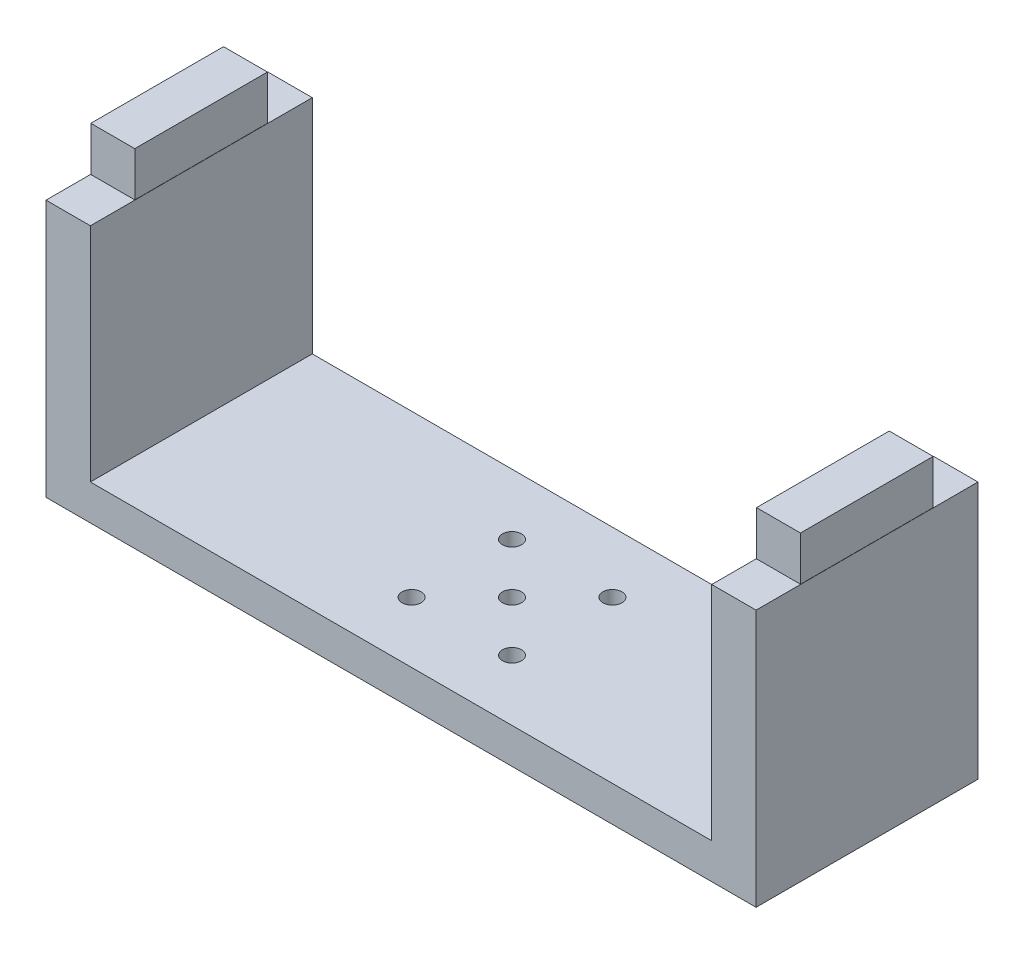
ISO-10303-21;
HEADER;
FILE_DESCRIPTION(('STEP AP214'),'2;1');
FILE_NAME('part.step','',(''),(''),'','','');
FILE_SCHEMA(('AUTOMOTIVE_DESIGN { 1 0 10303 214 1 1 1 1 }'));
ENDSEC;
DATA;
#1=APPLICATION_CONTEXT('core data for automotive mechanical design processes');
#2=APPLICATION_PROTOCOL_DEFINITION('international standard','automotive_design',2000,#1);
#3=PRODUCT_CONTEXT('',#1,'mechanical');
#4=PRODUCT('Part','Part','',(#3));
#5=PRODUCT_RELATED_PRODUCT_CATEGORY('part','',(#4));
#6=PRODUCT_DEFINITION_FORMATION('','',#4);
#7=PRODUCT_DEFINITION_CONTEXT('part definition',#1,'design');
#8=PRODUCT_DEFINITION('design','',#6,#7);
#9=PRODUCT_DEFINITION_SHAPE('','',#8);
#10=(LENGTH_UNIT() NAMED_UNIT(*) SI_UNIT(.MILLI.,.METRE.));
#11=(NAMED_UNIT(*) PLANE_ANGLE_UNIT() SI_UNIT($,.RADIAN.));
#12=(NAMED_UNIT(*) SI_UNIT($,.STERADIAN.) SOLID_ANGLE_UNIT());
#13=UNCERTAINTY_MEASURE_WITH_UNIT(LENGTH_MEASURE(1.E-05),#10,'distance_accuracy_value','');
#14=(GEOMETRIC_REPRESENTATION_CONTEXT(3) GLOBAL_UNCERTAINTY_ASSIGNED_CONTEXT((#13)) GLOBAL_UNIT_ASSIGNED_CONTEXT((#10,
#11,#12)) REPRESENTATION_CONTEXT('',''));
#15=CARTESIAN_POINT('',(0.,0.,0.));
#16=DIRECTION('',(0.,0.,1.));
#17=DIRECTION('',(1.,0.,0.));
#18=AXIS2_PLACEMENT_3D('',#15,#16,#17);
#19=CARTESIAN_POINT('',(0.,58.,0.));
#20=DIRECTION('',(0.,-1.,0.));
#21=DIRECTION('',(0.,0.,-1.));
#22=AXIS2_PLACEMENT_3D('',#19,#20,#21);
#23=PLANE('',#22);
#24=DIRECTION('',(0.,0.,-1.));
#25=VECTOR('',#24,1.);
#26=CARTESIAN_POINT('',(80.0000000000002,58.,-25.));
#27=LINE('',#26,#25);
#28=CARTESIAN_POINT('',(80.0000000000002,58.,25.));
#29=VERTEX_POINT('',#28);
#30=CARTESIAN_POINT('',(80.0000000000002,58.,-25.));
#31=VERTEX_POINT('',#30);
#32=EDGE_CURVE('E225',#29,#31,#27,.T.);
#33=ORIENTED_EDGE('',*,*,#32,.T.);
#34=DIRECTION('',(-1.,0.,0.));
#35=VECTOR('',#34,1.);
#36=CARTESIAN_POINT('',(80.0000000000002,58.,-25.));
#37=LINE('',#36,#35);
#38=CARTESIAN_POINT('',(70.0000000000002,58.,-25.));
#39=VERTEX_POINT('',#38);
#40=EDGE_CURVE('E229',#31,#39,#37,.T.);
#41=ORIENTED_EDGE('',*,*,#40,.T.);
#42=DIRECTION('',(0.,0.,1.));
#43=VECTOR('',#42,1.);
#44=CARTESIAN_POINT('',(70.0000000000002,58.,-25.));
#45=LINE('',#44,#43);
#46=CARTESIAN_POINT('',(70.0000000000001,58.,25.));
#47=VERTEX_POINT('',#46);
#48=EDGE_CURVE('E232',#39,#47,#45,.T.);
#49=ORIENTED_EDGE('',*,*,#48,.T.);
#50=DIRECTION('',(1.,0.,0.));
#51=VECTOR('',#50,1.);
#52=CARTESIAN_POINT('',(80.0000000000002,58.,25.));
#53=LINE('',#52,#51);
#54=EDGE_CURVE('E235',#47,#29,#53,.T.);
#55=ORIENTED_EDGE('',*,*,#54,.T.);
#56=EDGE_LOOP('',(#33,#41,#49,#55));
#57=FACE_BOUND('',#56,.T.);
#58=DIRECTION('',(0.,0.,1.));
#59=VECTOR('',#58,1.);
#60=CARTESIAN_POINT('',(70.0499999999999,58.,14.9499999999999));
#61=LINE('',#60,#59);
#62=CARTESIAN_POINT('',(70.0499999999999,58.,-14.95));
#63=VERTEX_POINT('',#62);
#64=CARTESIAN_POINT('',(70.0499999999999,58.,14.9499999999999));
#65=VERTEX_POINT('',#64);
#66=EDGE_CURVE('E175',#63,#65,#61,.T.);
#67=ORIENTED_EDGE('',*,*,#66,.F.);
#68=DIRECTION('',(-1.,0.,0.));
#69=VECTOR('',#68,1.);
#70=CARTESIAN_POINT('',(70.0499999999999,58.,-14.95));
#71=LINE('',#70,#69);
#72=CARTESIAN_POINT('',(79.9499999999998,58.,-14.95));
#73=VERTEX_POINT('',#72);
#74=EDGE_CURVE('E172',#73,#63,#71,.T.);
#75=ORIENTED_EDGE('',*,*,#74,.F.);
#76=DIRECTION('',(0.,0.,-1.));
#77=VECTOR('',#76,1.);
#78=CARTESIAN_POINT('',(79.9499999999998,58.,14.9499999999999));
#79=LINE('',#78,#77);
#80=CARTESIAN_POINT('',(79.9499999999998,58.,14.9499999999999));
#81=VERTEX_POINT('',#80);
#82=EDGE_CURVE('E60',#81,#73,#79,.T.);
#83=ORIENTED_EDGE('',*,*,#82,.F.);
#84=DIRECTION('',(1.,0.,0.));
#85=VECTOR('',#84,1.);
#86=CARTESIAN_POINT('',(70.0499999999999,58.,14.9499999999999));
#87=LINE('',#86,#85);
#88=EDGE_CURVE('E55',#65,#81,#87,.T.);
#89=ORIENTED_EDGE('',*,*,#88,.F.);
#90=EDGE_LOOP('',(#67,#75,#83,#89));
#91=FACE_BOUND('',#90,.T.);
#92=ADVANCED_FACE('F39',(#57,#91),#23,.F.);
#93=CARTESIAN_POINT('',(0.,58.,0.));
#94=DIRECTION('',(0.,1.,0.));
#95=DIRECTION('',(0.,0.,1.));
#96=AXIS2_PLACEMENT_3D('',#93,#94,#95);
#97=PLANE('',#96);
#98=DIRECTION('',(0.,0.,1.));
#99=VECTOR('',#98,1.);
#100=CARTESIAN_POINT('',(-79.9999999999998,58.,-25.));
#101=LINE('',#100,#99);
#102=CARTESIAN_POINT('',(-79.9999999999998,58.,-25.));
#103=VERTEX_POINT('',#102);
#104=CARTESIAN_POINT('',(-79.9999999999998,58.,25.));
#105=VERTEX_POINT('',#104);
#106=EDGE_CURVE('E251',#103,#105,#101,.T.);
#107=ORIENTED_EDGE('',*,*,#106,.T.);
#108=DIRECTION('',(1.,0.,0.));
#109=VECTOR('',#108,1.);
#110=CARTESIAN_POINT('',(-79.9999999999998,58.,25.));
#111=LINE('',#110,#109);
#112=CARTESIAN_POINT('',(-69.9999999999998,58.,25.));
#113=VERTEX_POINT('',#112);
#114=EDGE_CURVE('E255',#105,#113,#111,.T.);
#115=ORIENTED_EDGE('',*,*,#114,.T.);
#116=DIRECTION('',(0.,0.,-1.));
#117=VECTOR('',#116,1.);
#118=CARTESIAN_POINT('',(-69.9999999999999,58.,-25.));
#119=LINE('',#118,#117);
#120=CARTESIAN_POINT('',(-69.9999999999999,58.,-25.));
#121=VERTEX_POINT('',#120);
#122=EDGE_CURVE('E258',#113,#121,#119,.T.);
#123=ORIENTED_EDGE('',*,*,#122,.T.);
#124=DIRECTION('',(-1.,0.,0.));
#125=VECTOR('',#124,1.);
#126=CARTESIAN_POINT('',(-79.9999999999998,58.,-25.));
#127=LINE('',#126,#125);
#128=EDGE_CURVE('E261',#121,#103,#127,.T.);
#129=ORIENTED_EDGE('',*,*,#128,.T.);
#130=EDGE_LOOP('',(#107,#115,#123,#129));
#131=FACE_BOUND('',#130,.T.);
#132=DIRECTION('',(-1.,0.,0.));
#133=VECTOR('',#132,1.);
#134=CARTESIAN_POINT('',(-70.0499999999999,58.,-14.95));
#135=LINE('',#134,#133);
#136=CARTESIAN_POINT('',(-70.0499999999999,58.,-14.95));
#137=VERTEX_POINT('',#136);
#138=CARTESIAN_POINT('',(-79.9499999999998,58.,-14.95));
#139=VERTEX_POINT('',#138);
#140=EDGE_CURVE('E182',#137,#139,#135,.T.);
#141=ORIENTED_EDGE('',*,*,#140,.F.);
#142=DIRECTION('',(0.,0.,-1.));
#143=VECTOR('',#142,1.);
#144=CARTESIAN_POINT('',(-70.0499999999999,58.,14.95));
#145=LINE('',#144,#143);
#146=CARTESIAN_POINT('',(-70.0499999999999,58.,14.95));
#147=VERTEX_POINT('',#146);
#148=EDGE_CURVE('E177',#147,#137,#145,.T.);
#149=ORIENTED_EDGE('',*,*,#148,.F.);
#150=DIRECTION('',(1.,0.,0.));
#151=VECTOR('',#150,1.);
#152=CARTESIAN_POINT('',(-70.0499999999999,58.,14.95));
#153=LINE('',#152,#151);
#154=CARTESIAN_POINT('',(-79.9499999999998,58.,14.95));
#155=VERTEX_POINT('',#154);
#156=EDGE_CURVE('E193',#155,#147,#153,.T.);
#157=ORIENTED_EDGE('',*,*,#156,.F.);
#158=DIRECTION('',(0.,0.,1.));
#159=VECTOR('',#158,1.);
#160=CARTESIAN_POINT('',(-79.9499999999998,58.,14.95));
#161=LINE('',#160,#159);
#162=EDGE_CURVE('E205',#139,#155,#161,.T.);
#163=ORIENTED_EDGE('',*,*,#162,.F.);
#164=EDGE_LOOP('',(#141,#149,#157,#163));
#165=FACE_BOUND('',#164,.T.);
#166=ADVANCED_FACE('F322',(#131,#165),#97,.T.);
#167=CARTESIAN_POINT('',(0.,8.,0.));
#168=DIRECTION('',(0.,1.,0.));
#169=DIRECTION('',(0.,0.,1.));
#170=AXIS2_PLACEMENT_3D('',#167,#168,#169);
#171=PLANE('',#170);
#172=CARTESIAN_POINT('',(-11.3137084989849,8.,-11.3137084989847));
#173=DIRECTION('',(0.,1.,0.));
#174=DIRECTION('',(0.,0.,1.));
#175=AXIS2_PLACEMENT_3D('',#172,#173,#174);
#176=CIRCLE('',#175,2.15);
#177=CARTESIAN_POINT('',(-11.3137084989849,8.,-9.16370849898466));
#178=VERTEX_POINT('',#177);
#179=EDGE_CURVE('E373',#178,#178,#176,.F.);
#180=ORIENTED_EDGE('',*,*,#179,.T.);
#181=EDGE_LOOP('',(#180));
#182=FACE_BOUND('',#181,.T.);
#183=CARTESIAN_POINT('',(11.3137084989847,8.,-11.3137084989848));
#184=DIRECTION('',(0.,1.,0.));
#185=DIRECTION('',(0.,0.,1.));
#186=AXIS2_PLACEMENT_3D('',#183,#184,#185);
#187=CIRCLE('',#186,2.15);
#188=CARTESIAN_POINT('',(11.3137084989847,8.,-9.16370849898483));
#189=VERTEX_POINT('',#188);
#190=EDGE_CURVE('E381',#189,#189,#187,.F.);
#191=ORIENTED_EDGE('',*,*,#190,.T.);
#192=EDGE_LOOP('',(#191));
#193=FACE_BOUND('',#192,.T.);
#194=CARTESIAN_POINT('',(11.3137084989848,8.,11.3137084989847));
#195=DIRECTION('',(0.,1.,0.));
#196=DIRECTION('',(0.,0.,1.));
#197=AXIS2_PLACEMENT_3D('',#194,#195,#196);
#198=CIRCLE('',#197,2.15);
#199=CARTESIAN_POINT('',(11.3137084989848,8.,13.4637084989847));
#200=VERTEX_POINT('',#199);
#201=EDGE_CURVE('E389',#200,#200,#198,.F.);
#202=ORIENTED_EDGE('',*,*,#201,.T.);
#203=EDGE_LOOP('',(#202));
#204=FACE_BOUND('',#203,.T.);
#205=CARTESIAN_POINT('',(-11.3137084989848,8.,11.3137084989847));
#206=DIRECTION('',(0.,1.,0.));
#207=DIRECTION('',(0.,0.,1.));
#208=AXIS2_PLACEMENT_3D('',#205,#206,#207);
#209=CIRCLE('',#208,2.15);
#210=CARTESIAN_POINT('',(-11.3137084989848,8.,13.4637084989847));
#211=VERTEX_POINT('',#210);
#212=EDGE_CURVE('E397',#211,#211,#209,.F.);
#213=ORIENTED_EDGE('',*,*,#212,.T.);
#214=EDGE_LOOP('',(#213));
#215=FACE_BOUND('',#214,.T.);
#216=CARTESIAN_POINT('',(0.,8.,0.));
#217=DIRECTION('',(0.,1.,0.));
#218=DIRECTION('',(0.,0.,1.));
#219=AXIS2_PLACEMENT_3D('',#216,#217,#218);
#220=CIRCLE('',#219,2.15);
#221=CARTESIAN_POINT('',(0.,8.,2.15));
#222=VERTEX_POINT('',#221);
#223=EDGE_CURVE('E365',#222,#222,#220,.F.);
#224=ORIENTED_EDGE('',*,*,#223,.T.);
#225=EDGE_LOOP('',(#224));
#226=FACE_BOUND('',#225,.T.);
#227=DIRECTION('',(1.,0.,0.));
#228=VECTOR('',#227,1.);
#229=CARTESIAN_POINT('',(80.0000000000002,8.,25.));
#230=LINE('',#229,#228);
#231=CARTESIAN_POINT('',(-69.9999999999998,8.,25.));
#232=VERTEX_POINT('',#231);
#233=CARTESIAN_POINT('',(70.0000000000001,8.,25.));
#234=VERTEX_POINT('',#233);
#235=EDGE_CURVE('E277',#232,#234,#230,.T.);
#236=ORIENTED_EDGE('',*,*,#235,.T.);
#237=DIRECTION('',(0.,0.,1.));
#238=VECTOR('',#237,1.);
#239=CARTESIAN_POINT('',(70.0000000000002,8.,-25.));
#240=LINE('',#239,#238);
#241=CARTESIAN_POINT('',(70.0000000000001,8.,-25.));
#242=VERTEX_POINT('',#241);
#243=EDGE_CURVE('E224',#242,#234,#240,.T.);
#244=ORIENTED_EDGE('',*,*,#243,.F.);
#245=DIRECTION('',(-1.,0.,0.));
#246=VECTOR('',#245,1.);
#247=CARTESIAN_POINT('',(80.0000000000002,8.,-25.));
#248=LINE('',#247,#246);
#249=CARTESIAN_POINT('',(-69.9999999999999,8.,-25.));
#250=VERTEX_POINT('',#249);
#251=EDGE_CURVE('E280',#242,#250,#248,.T.);
#252=ORIENTED_EDGE('',*,*,#251,.T.);
#253=DIRECTION('',(0.,0.,-1.));
#254=VECTOR('',#253,1.);
#255=CARTESIAN_POINT('',(-69.9999999999999,8.,-25.));
#256=LINE('',#255,#254);
#257=EDGE_CURVE('E250',#232,#250,#256,.T.);
#258=ORIENTED_EDGE('',*,*,#257,.F.);
#259=EDGE_LOOP('',(#236,#244,#252,#258));
#260=FACE_BOUND('',#259,.T.);
#261=ADVANCED_FACE('F333',(#182,#193,#204,#215,#226,#260),#171,.T.);
#262=CARTESIAN_POINT('',(-79.9999999999998,8.,25.));
#263=DIRECTION('',(1.,0.,0.));
#264=DIRECTION('',(0.,0.,-1.));
#265=AXIS2_PLACEMENT_3D('',#262,#263,#264);
#266=PLANE('',#265);
#267=DIRECTION('',(0.,0.,1.));
#268=VECTOR('',#267,1.);
#269=CARTESIAN_POINT('',(-79.9999999999998,0.,25.));
#270=LINE('',#269,#268);
#271=CARTESIAN_POINT('',(-79.9999999999998,0.,-25.));
#272=VERTEX_POINT('',#271);
#273=CARTESIAN_POINT('',(-79.9999999999998,0.,25.));
#274=VERTEX_POINT('',#273);
#275=EDGE_CURVE('E276',#272,#274,#270,.T.);
#276=ORIENTED_EDGE('',*,*,#275,.T.);
#277=DIRECTION('',(0.,-1.,0.));
#278=VECTOR('',#277,1.);
#279=CARTESIAN_POINT('',(-79.9999999999998,8.,25.));
#280=LINE('',#279,#278);
#281=EDGE_CURVE('E11',#105,#274,#280,.T.);
#282=ORIENTED_EDGE('',*,*,#281,.F.);
#283=ORIENTED_EDGE('',*,*,#106,.F.);
#284=DIRECTION('',(0.,-1.,0.));
#285=VECTOR('',#284,1.);
#286=CARTESIAN_POINT('',(-79.9999999999998,8.,-25.));
#287=LINE('',#286,#285);
#288=EDGE_CURVE('E284',#103,#272,#287,.T.);
#289=ORIENTED_EDGE('',*,*,#288,.T.);
#290=EDGE_LOOP('',(#276,#282,#283,#289));
#291=FACE_BOUND('',#290,.T.);
#292=ADVANCED_FACE('F41',(#291),#266,.F.);
#293=CARTESIAN_POINT('',(80.0000000000002,8.,25.));
#294=DIRECTION('',(0.,0.,-1.));
#295=DIRECTION('',(-1.,0.,0.));
#296=AXIS2_PLACEMENT_3D('',#293,#294,#295);
#297=PLANE('',#296);
#298=DIRECTION('',(1.,0.,0.));
#299=VECTOR('',#298,1.);
#300=CARTESIAN_POINT('',(80.0000000000002,0.,25.));
#301=LINE('',#300,#299);
#302=CARTESIAN_POINT('',(80.0000000000002,0.,25.));
#303=VERTEX_POINT('',#302);
#304=EDGE_CURVE('E288',#274,#303,#301,.T.);
#305=ORIENTED_EDGE('',*,*,#304,.T.);
#306=DIRECTION('',(0.,-1.,0.));
#307=VECTOR('',#306,1.);
#308=CARTESIAN_POINT('',(80.0000000000002,8.,25.));
#309=LINE('',#308,#307);
#310=EDGE_CURVE('E48',#29,#303,#309,.T.);
#311=ORIENTED_EDGE('',*,*,#310,.F.);
#312=ORIENTED_EDGE('',*,*,#54,.F.);
#313=DIRECTION('',(0.,-1.,0.));
#314=VECTOR('',#313,1.);
#315=CARTESIAN_POINT('',(70.0000000000001,58.,25.));
#316=LINE('',#315,#314);
#317=EDGE_CURVE('E239',#47,#234,#316,.T.);
#318=ORIENTED_EDGE('',*,*,#317,.T.);
#319=ORIENTED_EDGE('',*,*,#235,.F.);
#320=DIRECTION('',(0.,-1.,0.));
#321=VECTOR('',#320,1.);
#322=CARTESIAN_POINT('',(-69.9999999999998,58.,25.));
#323=LINE('',#322,#321);
#324=EDGE_CURVE('E272',#113,#232,#323,.T.);
#325=ORIENTED_EDGE('',*,*,#324,.F.);
#326=ORIENTED_EDGE('',*,*,#114,.F.);
#327=ORIENTED_EDGE('',*,*,#281,.T.);
#328=EDGE_LOOP('',(#305,#311,#312,#318,#319,#325,#326,#327));
#329=FACE_BOUND('',#328,.T.);
#330=ADVANCED_FACE('F334',(#329),#297,.F.);
#331=CARTESIAN_POINT('',(80.0000000000002,8.,25.));
#332=DIRECTION('',(-1.,0.,0.));
#333=DIRECTION('',(0.,0.,1.));
#334=AXIS2_PLACEMENT_3D('',#331,#332,#333);
#335=PLANE('',#334);
#336=DIRECTION('',(0.,0.,-1.));
#337=VECTOR('',#336,1.);
#338=CARTESIAN_POINT('',(80.0000000000002,0.,25.));
#339=LINE('',#338,#337);
#340=CARTESIAN_POINT('',(80.0000000000002,0.,-25.));
#341=VERTEX_POINT('',#340);
#342=EDGE_CURVE('E291',#303,#341,#339,.T.);
#343=ORIENTED_EDGE('',*,*,#342,.T.);
#344=DIRECTION('',(0.,-1.,0.));
#345=VECTOR('',#344,1.);
#346=CARTESIAN_POINT('',(80.0000000000002,8.,-25.));
#347=LINE('',#346,#345);
#348=EDGE_CURVE('E299',#31,#341,#347,.T.);
#349=ORIENTED_EDGE('',*,*,#348,.F.);
#350=ORIENTED_EDGE('',*,*,#32,.F.);
#351=ORIENTED_EDGE('',*,*,#310,.T.);
#352=EDGE_LOOP('',(#343,#349,#350,#351));
#353=FACE_BOUND('',#352,.T.);
#354=ADVANCED_FACE('F307',(#353),#335,.F.);
#355=CARTESIAN_POINT('',(80.0000000000002,8.,-25.));
#356=DIRECTION('',(0.,0.,1.));
#357=DIRECTION('',(1.,0.,0.));
#358=AXIS2_PLACEMENT_3D('',#355,#356,#357);
#359=PLANE('',#358);
#360=DIRECTION('',(-1.,0.,0.));
#361=VECTOR('',#360,1.);
#362=CARTESIAN_POINT('',(80.0000000000002,0.,-25.));
#363=LINE('',#362,#361);
#364=EDGE_CURVE('E281',#341,#272,#363,.T.);
#365=ORIENTED_EDGE('',*,*,#364,.T.);
#366=ORIENTED_EDGE('',*,*,#288,.F.);
#367=ORIENTED_EDGE('',*,*,#128,.F.);
#368=DIRECTION('',(0.,-1.,0.));
#369=VECTOR('',#368,1.);
#370=CARTESIAN_POINT('',(-69.9999999999999,58.,-25.));
#371=LINE('',#370,#369);
#372=EDGE_CURVE('E265',#121,#250,#371,.T.);
#373=ORIENTED_EDGE('',*,*,#372,.T.);
#374=ORIENTED_EDGE('',*,*,#251,.F.);
#375=DIRECTION('',(0.,-1.,0.));
#376=VECTOR('',#375,1.);
#377=CARTESIAN_POINT('',(70.0000000000002,58.,-25.));
#378=LINE('',#377,#376);
#379=EDGE_CURVE('E246',#39,#242,#378,.T.);
#380=ORIENTED_EDGE('',*,*,#379,.F.);
#381=ORIENTED_EDGE('',*,*,#40,.F.);
#382=ORIENTED_EDGE('',*,*,#348,.T.);
#383=EDGE_LOOP('',(#365,#366,#367,#373,#374,#380,#381,#382));
#384=FACE_BOUND('',#383,.T.);
#385=ADVANCED_FACE('F315',(#384),#359,.F.);
#386=CARTESIAN_POINT('',(0.,0.,0.));
#387=DIRECTION('',(0.,1.,0.));
#388=DIRECTION('',(0.,0.,1.));
#389=AXIS2_PLACEMENT_3D('',#386,#387,#388);
#390=PLANE('',#389);
#391=CARTESIAN_POINT('',(-11.3137084989849,0.,-11.3137084989847));
#392=DIRECTION('',(0.,-1.,0.));
#393=DIRECTION('',(0.,0.,-1.));
#394=AXIS2_PLACEMENT_3D('',#391,#392,#393);
#395=CIRCLE('',#394,2.15);
#396=CARTESIAN_POINT('',(-11.3137084989849,0.,-13.4637084989847));
#397=VERTEX_POINT('',#396);
#398=EDGE_CURVE('E377',#397,#397,#395,.T.);
#399=ORIENTED_EDGE('',*,*,#398,.F.);
#400=EDGE_LOOP('',(#399));
#401=FACE_BOUND('',#400,.T.);
#402=CARTESIAN_POINT('',(11.3137084989847,0.,-11.3137084989848));
#403=DIRECTION('',(0.,-1.,0.));
#404=DIRECTION('',(0.,0.,-1.));
#405=AXIS2_PLACEMENT_3D('',#402,#403,#404);
#406=CIRCLE('',#405,2.15);
#407=CARTESIAN_POINT('',(11.3137084989847,0.,-13.4637084989848));
#408=VERTEX_POINT('',#407);
#409=EDGE_CURVE('E385',#408,#408,#406,.T.);
#410=ORIENTED_EDGE('',*,*,#409,.F.);
#411=EDGE_LOOP('',(#410));
#412=FACE_BOUND('',#411,.T.);
#413=CARTESIAN_POINT('',(11.3137084989848,0.,11.3137084989847));
#414=DIRECTION('',(0.,-1.,0.));
#415=DIRECTION('',(0.,0.,-1.));
#416=AXIS2_PLACEMENT_3D('',#413,#414,#415);
#417=CIRCLE('',#416,2.15);
#418=CARTESIAN_POINT('',(11.3137084989848,0.,9.16370849898473));
#419=VERTEX_POINT('',#418);
#420=EDGE_CURVE('E393',#419,#419,#417,.T.);
#421=ORIENTED_EDGE('',*,*,#420,.F.);
#422=EDGE_LOOP('',(#421));
#423=FACE_BOUND('',#422,.T.);
#424=CARTESIAN_POINT('',(-11.3137084989848,0.,11.3137084989847));
#425=DIRECTION('',(0.,-1.,0.));
#426=DIRECTION('',(0.,0.,-1.));
#427=AXIS2_PLACEMENT_3D('',#424,#425,#426);
#428=CIRCLE('',#427,2.15);
#429=CARTESIAN_POINT('',(-11.3137084989848,0.,9.16370849898475));
#430=VERTEX_POINT('',#429);
#431=EDGE_CURVE('E369',#430,#430,#428,.T.);
#432=ORIENTED_EDGE('',*,*,#431,.F.);
#433=EDGE_LOOP('',(#432));
#434=FACE_BOUND('',#433,.T.);
#435=CARTESIAN_POINT('',(0.,0.,0.));
#436=DIRECTION('',(0.,-1.,0.));
#437=DIRECTION('',(0.,0.,-1.));
#438=AXIS2_PLACEMENT_3D('',#435,#436,#437);
#439=CIRCLE('',#438,2.15);
#440=CARTESIAN_POINT('',(0.,0.,-2.15));
#441=VERTEX_POINT('',#440);
#442=EDGE_CURVE('E344',#441,#441,#439,.T.);
#443=ORIENTED_EDGE('',*,*,#442,.F.);
#444=EDGE_LOOP('',(#443));
#445=FACE_BOUND('',#444,.T.);
#446=ORIENTED_EDGE('',*,*,#275,.F.);
#447=ORIENTED_EDGE('',*,*,#364,.F.);
#448=ORIENTED_EDGE('',*,*,#342,.F.);
#449=ORIENTED_EDGE('',*,*,#304,.F.);
#450=EDGE_LOOP('',(#446,#447,#448,#449));
#451=FACE_BOUND('',#450,.T.);
#452=ADVANCED_FACE('F313',(#401,#412,#423,#434,#445,#451),#390,.F.);
#453=CARTESIAN_POINT('',(-69.9999999999999,58.,-25.));
#454=DIRECTION('',(-1.,0.,0.));
#455=DIRECTION('',(0.,0.,1.));
#456=AXIS2_PLACEMENT_3D('',#453,#454,#455);
#457=PLANE('',#456);
#458=ORIENTED_EDGE('',*,*,#257,.T.);
#459=ORIENTED_EDGE('',*,*,#372,.F.);
#460=ORIENTED_EDGE('',*,*,#122,.F.);
#461=ORIENTED_EDGE('',*,*,#324,.T.);
#462=EDGE_LOOP('',(#458,#459,#460,#461));
#463=FACE_BOUND('',#462,.T.);
#464=ADVANCED_FACE('F330',(#463),#457,.F.);
#465=CARTESIAN_POINT('',(70.0000000000002,58.,-25.));
#466=DIRECTION('',(1.,0.,0.));
#467=DIRECTION('',(0.,0.,-1.));
#468=AXIS2_PLACEMENT_3D('',#465,#466,#467);
#469=PLANE('',#468);
#470=ORIENTED_EDGE('',*,*,#243,.T.);
#471=ORIENTED_EDGE('',*,*,#317,.F.);
#472=ORIENTED_EDGE('',*,*,#48,.F.);
#473=ORIENTED_EDGE('',*,*,#379,.T.);
#474=EDGE_LOOP('',(#470,#471,#472,#473));
#475=FACE_BOUND('',#474,.T.);
#476=ADVANCED_FACE('F338',(#475),#469,.F.);
#477=CARTESIAN_POINT('',(-70.0499999999999,68.,14.95));
#478=DIRECTION('',(-1.,0.,0.));
#479=DIRECTION('',(0.,0.,1.));
#480=AXIS2_PLACEMENT_3D('',#477,#478,#479);
#481=PLANE('',#480);
#482=ORIENTED_EDGE('',*,*,#148,.T.);
#483=DIRECTION('',(0.,-1.,0.));
#484=VECTOR('',#483,1.);
#485=CARTESIAN_POINT('',(-70.0499999999999,68.,-14.95));
#486=LINE('',#485,#484);
#487=CARTESIAN_POINT('',(-70.0499999999999,68.,-14.95));
#488=VERTEX_POINT('',#487);
#489=EDGE_CURVE('E221',#488,#137,#486,.T.);
#490=ORIENTED_EDGE('',*,*,#489,.F.);
#491=DIRECTION('',(0.,0.,-1.));
#492=VECTOR('',#491,1.);
#493=CARTESIAN_POINT('',(-70.0499999999999,68.,14.95));
#494=LINE('',#493,#492);
#495=CARTESIAN_POINT('',(-70.0499999999999,68.,14.95));
#496=VERTEX_POINT('',#495);
#497=EDGE_CURVE('E188',#496,#488,#494,.T.);
#498=ORIENTED_EDGE('',*,*,#497,.F.);
#499=DIRECTION('',(0.,-1.,0.));
#500=VECTOR('',#499,1.);
#501=CARTESIAN_POINT('',(-70.0499999999999,68.,14.95));
#502=LINE('',#501,#500);
#503=EDGE_CURVE('E201',#496,#147,#502,.T.);
#504=ORIENTED_EDGE('',*,*,#503,.T.);
#505=EDGE_LOOP('',(#482,#490,#498,#504));
#506=FACE_BOUND('',#505,.T.);
#507=ADVANCED_FACE('F455',(#506),#481,.F.);
#508=CARTESIAN_POINT('',(-70.0499999999999,68.,-14.95));
#509=DIRECTION('',(0.,0.,1.));
#510=DIRECTION('',(1.,0.,0.));
#511=AXIS2_PLACEMENT_3D('',#508,#509,#510);
#512=PLANE('',#511);
#513=ORIENTED_EDGE('',*,*,#140,.T.);
#514=DIRECTION('',(0.,-1.,0.));
#515=VECTOR('',#514,1.);
#516=CARTESIAN_POINT('',(-79.9499999999998,68.,-14.95));
#517=LINE('',#516,#515);
#518=CARTESIAN_POINT('',(-79.9499999999998,68.,-14.95));
#519=VERTEX_POINT('',#518);
#520=EDGE_CURVE('E217',#519,#139,#517,.T.);
#521=ORIENTED_EDGE('',*,*,#520,.F.);
#522=DIRECTION('',(-1.,0.,0.));
#523=VECTOR('',#522,1.);
#524=CARTESIAN_POINT('',(-70.0499999999999,68.,-14.95));
#525=LINE('',#524,#523);
#526=EDGE_CURVE('E192',#488,#519,#525,.T.);
#527=ORIENTED_EDGE('',*,*,#526,.F.);
#528=ORIENTED_EDGE('',*,*,#489,.T.);
#529=EDGE_LOOP('',(#513,#521,#527,#528));
#530=FACE_BOUND('',#529,.T.);
#531=ADVANCED_FACE('F451',(#530),#512,.F.);
#532=CARTESIAN_POINT('',(-79.9499999999998,68.,14.95));
#533=DIRECTION('',(1.,0.,0.));
#534=DIRECTION('',(0.,0.,-1.));
#535=AXIS2_PLACEMENT_3D('',#532,#533,#534);
#536=PLANE('',#535);
#537=ORIENTED_EDGE('',*,*,#162,.T.);
#538=DIRECTION('',(0.,-1.,0.));
#539=VECTOR('',#538,1.);
#540=CARTESIAN_POINT('',(-79.9499999999998,68.,14.95));
#541=LINE('',#540,#539);
#542=CARTESIAN_POINT('',(-79.9499999999998,68.,14.95));
#543=VERTEX_POINT('',#542);
#544=EDGE_CURVE('E214',#543,#155,#541,.T.);
#545=ORIENTED_EDGE('',*,*,#544,.F.);
#546=DIRECTION('',(0.,0.,1.));
#547=VECTOR('',#546,1.);
#548=CARTESIAN_POINT('',(-79.9499999999998,68.,14.95));
#549=LINE('',#548,#547);
#550=EDGE_CURVE('E196',#519,#543,#549,.T.);
#551=ORIENTED_EDGE('',*,*,#550,.F.);
#552=ORIENTED_EDGE('',*,*,#520,.T.);
#553=EDGE_LOOP('',(#537,#545,#551,#552));
#554=FACE_BOUND('',#553,.T.);
#555=ADVANCED_FACE('F447',(#554),#536,.F.);
#556=CARTESIAN_POINT('',(-70.0499999999999,68.,14.95));
#557=DIRECTION('',(0.,0.,-1.));
#558=DIRECTION('',(-1.,0.,0.));
#559=AXIS2_PLACEMENT_3D('',#556,#557,#558);
#560=PLANE('',#559);
#561=ORIENTED_EDGE('',*,*,#156,.T.);
#562=ORIENTED_EDGE('',*,*,#503,.F.);
#563=DIRECTION('',(1.,0.,0.));
#564=VECTOR('',#563,1.);
#565=CARTESIAN_POINT('',(-70.0499999999999,68.,14.95));
#566=LINE('',#565,#564);
#567=EDGE_CURVE('E199',#543,#496,#566,.T.);
#568=ORIENTED_EDGE('',*,*,#567,.F.);
#569=ORIENTED_EDGE('',*,*,#544,.T.);
#570=EDGE_LOOP('',(#561,#562,#568,#569));
#571=FACE_BOUND('',#570,.T.);
#572=ADVANCED_FACE('F443',(#571),#560,.F.);
#573=CARTESIAN_POINT('',(0.,68.,0.));
#574=DIRECTION('',(0.,1.,0.));
#575=DIRECTION('',(0.,0.,1.));
#576=AXIS2_PLACEMENT_3D('',#573,#574,#575);
#577=PLANE('',#576);
#578=ORIENTED_EDGE('',*,*,#497,.T.);
#579=ORIENTED_EDGE('',*,*,#526,.T.);
#580=ORIENTED_EDGE('',*,*,#550,.T.);
#581=ORIENTED_EDGE('',*,*,#567,.T.);
#582=EDGE_LOOP('',(#578,#579,#580,#581));
#583=FACE_BOUND('',#582,.T.);
#584=ADVANCED_FACE('F440',(#583),#577,.T.);
#585=CARTESIAN_POINT('',(70.0499999999999,68.,14.9499999999999));
#586=DIRECTION('',(1.,0.,0.));
#587=DIRECTION('',(0.,0.,-1.));
#588=AXIS2_PLACEMENT_3D('',#585,#586,#587);
#589=PLANE('',#588);
#590=ORIENTED_EDGE('',*,*,#66,.T.);
#591=DIRECTION('',(0.,-1.,0.));
#592=VECTOR('',#591,1.);
#593=CARTESIAN_POINT('',(70.0499999999999,68.,14.9499999999999));
#594=LINE('',#593,#592);
#595=CARTESIAN_POINT('',(70.0499999999999,68.,14.9499999999999));
#596=VERTEX_POINT('',#595);
#597=EDGE_CURVE('E154',#596,#65,#594,.T.);
#598=ORIENTED_EDGE('',*,*,#597,.F.);
#599=DIRECTION('',(0.,0.,1.));
#600=VECTOR('',#599,1.);
#601=CARTESIAN_POINT('',(70.0499999999999,68.,14.9499999999999));
#602=LINE('',#601,#600);
#603=CARTESIAN_POINT('',(70.0499999999999,68.,-14.95));
#604=VERTEX_POINT('',#603);
#605=EDGE_CURVE('E162',#604,#596,#602,.T.);
#606=ORIENTED_EDGE('',*,*,#605,.F.);
#607=DIRECTION('',(0.,-1.,0.));
#608=VECTOR('',#607,1.);
#609=CARTESIAN_POINT('',(70.0499999999999,68.,-14.95));
#610=LINE('',#609,#608);
#611=EDGE_CURVE('E349',#604,#63,#610,.T.);
#612=ORIENTED_EDGE('',*,*,#611,.T.);
#613=EDGE_LOOP('',(#590,#598,#606,#612));
#614=FACE_BOUND('',#613,.T.);
#615=ADVANCED_FACE('F174',(#614),#589,.F.);
#616=CARTESIAN_POINT('',(70.0499999999999,68.,14.9499999999999));
#617=DIRECTION('',(0.,0.,-1.));
#618=DIRECTION('',(-1.,0.,0.));
#619=AXIS2_PLACEMENT_3D('',#616,#617,#618);
#620=PLANE('',#619);
#621=ORIENTED_EDGE('',*,*,#88,.T.);
#622=DIRECTION('',(0.,-1.,0.));
#623=VECTOR('',#622,1.);
#624=CARTESIAN_POINT('',(79.9499999999998,68.,14.9499999999999));
#625=LINE('',#624,#623);
#626=CARTESIAN_POINT('',(79.9499999999998,68.,14.9499999999999));
#627=VERTEX_POINT('',#626);
#628=EDGE_CURVE('E157',#627,#81,#625,.T.);
#629=ORIENTED_EDGE('',*,*,#628,.F.);
#630=DIRECTION('',(1.,0.,0.));
#631=VECTOR('',#630,1.);
#632=CARTESIAN_POINT('',(70.0499999999999,68.,14.9499999999999));
#633=LINE('',#632,#631);
#634=EDGE_CURVE('E150',#596,#627,#633,.T.);
#635=ORIENTED_EDGE('',*,*,#634,.F.);
#636=ORIENTED_EDGE('',*,*,#597,.T.);
#637=EDGE_LOOP('',(#621,#629,#635,#636));
#638=FACE_BOUND('',#637,.T.);
#639=ADVANCED_FACE('F152',(#638),#620,.F.);
#640=CARTESIAN_POINT('',(79.9499999999998,68.,14.9499999999999));
#641=DIRECTION('',(-1.,0.,0.));
#642=DIRECTION('',(0.,0.,1.));
#643=AXIS2_PLACEMENT_3D('',#640,#641,#642);
#644=PLANE('',#643);
#645=ORIENTED_EDGE('',*,*,#82,.T.);
#646=DIRECTION('',(0.,-1.,0.));
#647=VECTOR('',#646,1.);
#648=CARTESIAN_POINT('',(79.9499999999998,68.,-14.95));
#649=LINE('',#648,#647);
#650=CARTESIAN_POINT('',(79.9499999999998,68.,-14.95));
#651=VERTEX_POINT('',#650);
#652=EDGE_CURVE('E184',#651,#73,#649,.T.);
#653=ORIENTED_EDGE('',*,*,#652,.F.);
#654=DIRECTION('',(0.,0.,-1.));
#655=VECTOR('',#654,1.);
#656=CARTESIAN_POINT('',(79.9499999999998,68.,14.9499999999999));
#657=LINE('',#656,#655);
#658=EDGE_CURVE('E161',#627,#651,#657,.T.);
#659=ORIENTED_EDGE('',*,*,#658,.F.);
#660=ORIENTED_EDGE('',*,*,#628,.T.);
#661=EDGE_LOOP('',(#645,#653,#659,#660));
#662=FACE_BOUND('',#661,.T.);
#663=ADVANCED_FACE('F432',(#662),#644,.F.);
#664=CARTESIAN_POINT('',(70.0499999999999,68.,-14.95));
#665=DIRECTION('',(0.,0.,1.));
#666=DIRECTION('',(1.,0.,0.));
#667=AXIS2_PLACEMENT_3D('',#664,#665,#666);
#668=PLANE('',#667);
#669=ORIENTED_EDGE('',*,*,#74,.T.);
#670=ORIENTED_EDGE('',*,*,#611,.F.);
#671=DIRECTION('',(-1.,0.,0.));
#672=VECTOR('',#671,1.);
#673=CARTESIAN_POINT('',(70.0499999999999,68.,-14.95));
#674=LINE('',#673,#672);
#675=EDGE_CURVE('E167',#651,#604,#674,.T.);
#676=ORIENTED_EDGE('',*,*,#675,.F.);
#677=ORIENTED_EDGE('',*,*,#652,.T.);
#678=EDGE_LOOP('',(#669,#670,#676,#677));
#679=FACE_BOUND('',#678,.T.);
#680=ADVANCED_FACE('F348',(#679),#668,.F.);
#681=CARTESIAN_POINT('',(0.,68.,0.));
#682=DIRECTION('',(0.,-1.,0.));
#683=DIRECTION('',(0.,0.,-1.));
#684=AXIS2_PLACEMENT_3D('',#681,#682,#683);
#685=PLANE('',#684);
#686=ORIENTED_EDGE('',*,*,#605,.T.);
#687=ORIENTED_EDGE('',*,*,#634,.T.);
#688=ORIENTED_EDGE('',*,*,#658,.T.);
#689=ORIENTED_EDGE('',*,*,#675,.T.);
#690=EDGE_LOOP('',(#686,#687,#688,#689));
#691=FACE_BOUND('',#690,.T.);
#692=ADVANCED_FACE('F165',(#691),#685,.F.);
#693=CARTESIAN_POINT('',(0.,68.001,0.));
#694=DIRECTION('',(0.,-1.,0.));
#695=DIRECTION('',(0.,0.,-1.));
#696=AXIS2_PLACEMENT_3D('',#693,#694,#695);
#697=CYLINDRICAL_SURFACE('',#696,2.15);
#698=ORIENTED_EDGE('',*,*,#223,.F.);
#699=EDGE_LOOP('',(#698));
#700=FACE_BOUND('',#699,.T.);
#701=ORIENTED_EDGE('',*,*,#442,.T.);
#702=EDGE_LOOP('',(#701));
#703=FACE_BOUND('',#702,.T.);
#704=ADVANCED_FACE('F413',(#700,#703),#697,.F.);
#705=CARTESIAN_POINT('',(-11.3137084989848,68.001,11.3137084989847));
#706=DIRECTION('',(0.,-1.,0.));
#707=DIRECTION('',(0.,0.,-1.));
#708=AXIS2_PLACEMENT_3D('',#705,#706,#707);
#709=CYLINDRICAL_SURFACE('',#708,2.15);
#710=ORIENTED_EDGE('',*,*,#212,.F.);
#711=EDGE_LOOP('',(#710));
#712=FACE_BOUND('',#711,.T.);
#713=ORIENTED_EDGE('',*,*,#431,.T.);
#714=EDGE_LOOP('',(#713));
#715=FACE_BOUND('',#714,.T.);
#716=ADVANCED_FACE('F405',(#712,#715),#709,.F.);
#717=CARTESIAN_POINT('',(11.3137084989848,68.001,11.3137084989847));
#718=DIRECTION('',(0.,-1.,0.));
#719=DIRECTION('',(0.,0.,-1.));
#720=AXIS2_PLACEMENT_3D('',#717,#718,#719);
#721=CYLINDRICAL_SURFACE('',#720,2.15);
#722=ORIENTED_EDGE('',*,*,#201,.F.);
#723=EDGE_LOOP('',(#722));
#724=FACE_BOUND('',#723,.T.);
#725=ORIENTED_EDGE('',*,*,#420,.T.);
#726=EDGE_LOOP('',(#725));
#727=FACE_BOUND('',#726,.T.);
#728=ADVANCED_FACE('F421',(#724,#727),#721,.F.);
#729=CARTESIAN_POINT('',(11.3137084989847,68.001,-11.3137084989848));
#730=DIRECTION('',(0.,-1.,0.));
#731=DIRECTION('',(0.,0.,-1.));
#732=AXIS2_PLACEMENT_3D('',#729,#730,#731);
#733=CYLINDRICAL_SURFACE('',#732,2.15);
#734=ORIENTED_EDGE('',*,*,#190,.F.);
#735=EDGE_LOOP('',(#734));
#736=FACE_BOUND('',#735,.T.);
#737=ORIENTED_EDGE('',*,*,#409,.T.);
#738=EDGE_LOOP('',(#737));
#739=FACE_BOUND('',#738,.T.);
#740=ADVANCED_FACE('F569',(#736,#739),#733,.F.);
#741=CARTESIAN_POINT('',(-11.3137084989849,68.001,-11.3137084989847));
#742=DIRECTION('',(0.,-1.,0.));
#743=DIRECTION('',(0.,0.,-1.));
#744=AXIS2_PLACEMENT_3D('',#741,#742,#743);
#745=CYLINDRICAL_SURFACE('',#744,2.15);
#746=ORIENTED_EDGE('',*,*,#179,.F.);
#747=EDGE_LOOP('',(#746));
#748=FACE_BOUND('',#747,.T.);
#749=ORIENTED_EDGE('',*,*,#398,.T.);
#750=EDGE_LOOP('',(#749));
#751=FACE_BOUND('',#750,.T.);
#752=ADVANCED_FACE('F427',(#748,#751),#745,.F.);
#753=CLOSED_SHELL('',(#92,#166,#261,#292,#330,#354,#385,#452,#464,#476,#507,#531,#555,#572,#584,
#615,#639,#663,#680,#692,#704,#716,#728,#740,#752));
#754=MANIFOLD_SOLID_BREP('B2',#753);
#755=ADVANCED_BREP_SHAPE_REPRESENTATION('',(#18,#754),#14);
#756=SHAPE_DEFINITION_REPRESENTATION(#9,#755);
ENDSEC;
END-ISO-10303-21;
